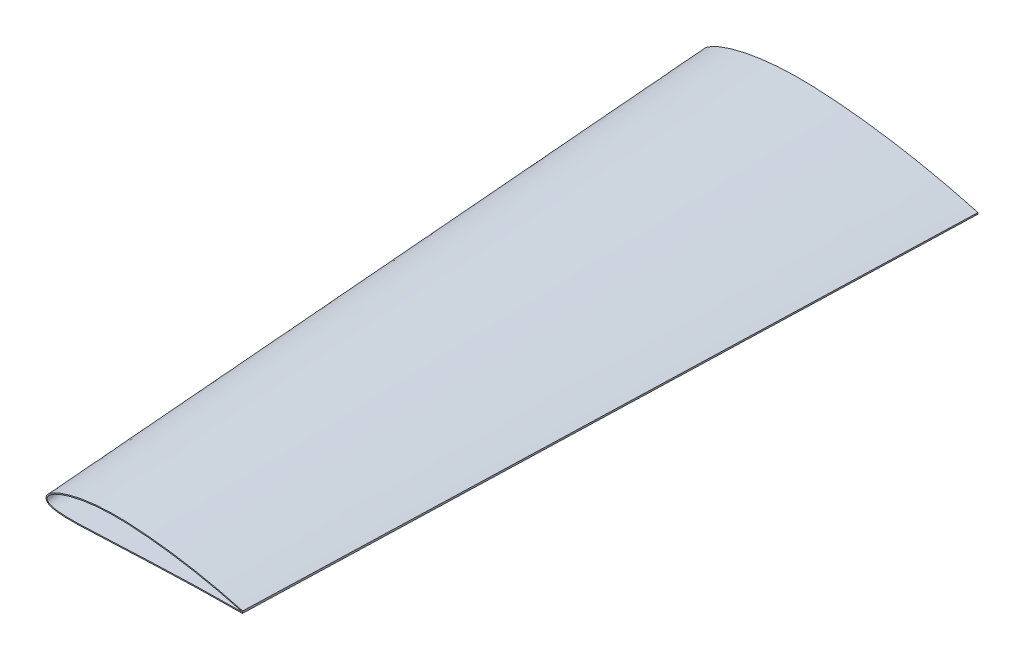
ISO-10303-21;
HEADER;
FILE_DESCRIPTION(('STEP AP214'),'2;1');
FILE_NAME('part.step','',(''),(''),'','','');
FILE_SCHEMA(('AUTOMOTIVE_DESIGN { 1 0 10303 214 1 1 1 1 }'));
ENDSEC;
DATA;
#1=APPLICATION_CONTEXT('core data for automotive mechanical design processes');
#2=APPLICATION_PROTOCOL_DEFINITION('international standard','automotive_design',2000,#1);
#3=PRODUCT_CONTEXT('',#1,'mechanical');
#4=PRODUCT('Part','Part','',(#3));
#5=PRODUCT_RELATED_PRODUCT_CATEGORY('part','',(#4));
#6=PRODUCT_DEFINITION_FORMATION('','',#4);
#7=PRODUCT_DEFINITION_CONTEXT('part definition',#1,'design');
#8=PRODUCT_DEFINITION('design','',#6,#7);
#9=PRODUCT_DEFINITION_SHAPE('','',#8);
#10=(LENGTH_UNIT() NAMED_UNIT(*) SI_UNIT(.MILLI.,.METRE.));
#11=(NAMED_UNIT(*) PLANE_ANGLE_UNIT() SI_UNIT($,.RADIAN.));
#12=(NAMED_UNIT(*) SI_UNIT($,.STERADIAN.) SOLID_ANGLE_UNIT());
#13=UNCERTAINTY_MEASURE_WITH_UNIT(LENGTH_MEASURE(1.E-05),#10,'distance_accuracy_value','');
#14=(GEOMETRIC_REPRESENTATION_CONTEXT(3) GLOBAL_UNCERTAINTY_ASSIGNED_CONTEXT((#13)) GLOBAL_UNIT_ASSIGNED_CONTEXT((#10,
#11,#12)) REPRESENTATION_CONTEXT('',''));
#15=CARTESIAN_POINT('',(0.,0.,0.));
#16=DIRECTION('',(0.,0.,1.));
#17=DIRECTION('',(1.,0.,0.));
#18=AXIS2_PLACEMENT_3D('',#15,#16,#17);
#19=CARTESIAN_POINT('',(515.542466757651,1.37291715323749,0.));
#20=CARTESIAN_POINT('',(473.761354348708,1.91504334392476,1333.5));
#21=CARTESIAN_POINT('',(504.948186056162,4.31562778068404,0.));
#22=CARTESIAN_POINT('',(466.241241660713,4.00387151815679,1333.5));
#23=CARTESIAN_POINT('',(483.688630885925,9.95175823918553,0.));
#24=CARTESIAN_POINT('',(451.160493971408,8.03690502890336,1333.5));
#25=CARTESIAN_POINT('',(440.91840439398,20.2408017386491,0.));
#26=CARTESIAN_POINT('',(420.805599887962,15.3578375738474,1333.5));
#27=CARTESIAN_POINT('',(397.820792051191,29.0759377638442,0.));
#28=CARTESIAN_POINT('',(390.221957363054,21.65962794748,1333.5));
#29=CARTESIAN_POINT('',(354.460600672312,36.4782376927597,0.));
#30=CARTESIAN_POINT('',(359.448862171338,26.9396472162238,1333.5));
#31=CARTESIAN_POINT('',(321.821436127745,41.287280697128,0.));
#32=CARTESIAN_POINT('',(336.282822397605,30.3682918829064,1333.5));
#33=CARTESIAN_POINT('',(289.075414397088,45.3159399144746,0.));
#34=CARTESIAN_POINT('',(313.039072197383,33.2450825322831,1333.5));
#35=CARTESIAN_POINT('',(256.234249309476,48.5142512287238,0.));
#36=CARTESIAN_POINT('',(289.723976775768,35.5318134186845,1333.5));
#37=CARTESIAN_POINT('',(223.317458576892,50.787173233681,0.));
#38=CARTESIAN_POINT('',(266.354818287414,37.1599691175304,1333.5));
#39=CARTESIAN_POINT('',(190.328241158101,52.0921492363557,0.));
#40=CARTESIAN_POINT('',(242.91690860674,38.106258583374,1333.5));
#41=CARTESIAN_POINT('',(162.799790856734,51.7149612737425,0.));
#42=CARTESIAN_POINT('',(223.339605024856,37.8569374336063,1333.5));
#43=CARTESIAN_POINT('',(140.815010685056,50.4814113602434,0.));
#44=CARTESIAN_POINT('',(207.702823599273,36.9927518576321,1333.5));
#45=CARTESIAN_POINT('',(124.359909385153,49.0521108646724,0.));
#46=CARTESIAN_POINT('',(195.99602938729,35.9854835703815,1333.5));
#47=CARTESIAN_POINT('',(107.957329171461,47.0863508807158,0.));
#48=CARTESIAN_POINT('',(184.323035776176,34.59573007404,1333.5));
#49=CARTESIAN_POINT('',(91.631280061329,44.5372092186544,0.));
#50=CARTESIAN_POINT('',(172.700036204777,32.7897404844962,1333.5));
#51=CARTESIAN_POINT('',(75.4136360051635,41.3429509123251,0.));
#52=CARTESIAN_POINT('',(161.148094659947,30.5229468259909,1333.5));
#53=CARTESIAN_POINT('',(62.025702194082,38.0735505204426,0.));
#54=CARTESIAN_POINT('',(151.604465980378,28.1992444571214,1333.5));
#55=CARTESIAN_POINT('',(51.4266197848401,35.0260164169072,0.));
#56=CARTESIAN_POINT('',(144.041887446398,26.0301562795153,1333.5));
#57=CARTESIAN_POINT('',(43.5465568697689,32.4984583099507,0.));
#58=CARTESIAN_POINT('',(138.41449545024,24.2291788913945,1333.5));
#59=CARTESIAN_POINT('',(35.7541118725182,29.6956733272348,0.));
#60=CARTESIAN_POINT('',(132.843221370915,22.2293587302536,1333.5));
#61=CARTESIAN_POINT('',(28.0755124200348,26.5705691180233,0.));
#62=CARTESIAN_POINT('',(127.343608813039,19.9952999808497,1333.5));
#63=CARTESIAN_POINT('',(20.555874406315,23.0470024261619,0.));
#64=CARTESIAN_POINT('',(121.942599672116,17.4689180578259,1333.5));
#65=CARTESIAN_POINT('',(14.4837569810482,19.6800078711009,0.));
#66=CARTESIAN_POINT('',(117.559968245804,15.04337614627,1333.5));
#67=CARTESIAN_POINT('',(9.83082821996991,16.6046362541371,0.));
#68=CARTESIAN_POINT('',(114.174757892656,12.8096231690394,1333.5));
#69=CARTESIAN_POINT('',(6.4884133940203,14.0525883692153,0.));
#70=CARTESIAN_POINT('',(111.721318113505,10.9395579815021,1333.5));
#71=CARTESIAN_POINT('',(3.37411745860041,11.1653229429713,0.));
#72=CARTESIAN_POINT('',(109.404447868835,8.79585196070452,1333.5));
#73=CARTESIAN_POINT('',(1.10893170730452,8.36681188823188,0.));
#74=CARTESIAN_POINT('',(107.664063642287,6.65710221065554,1333.5));
#75=CARTESIAN_POINT('',(-0.301805281426847,5.74949525675526,0.));
#76=CARTESIAN_POINT('',(106.551977804266,4.5904851843582,1333.5));
#77=CARTESIAN_POINT('',(-1.01759194588757,3.60243572224438,0.));
#78=CARTESIAN_POINT('',(105.953611387231,2.81739605685466,1333.5));
#79=CARTESIAN_POINT('',(-1.2495522623254,1.27648595976914,0.));
#80=CARTESIAN_POINT('',(105.759156489465,0.850568134802958,1333.5));
#81=CARTESIAN_POINT('',(-0.871053522600669,-1.0536259455248,0.));
#82=CARTESIAN_POINT('',(106.089924423004,-1.15154539440468,1333.5));
#83=CARTESIAN_POINT('',(0.0925312647460494,-3.18620229908168,0.));
#84=CARTESIAN_POINT('',(106.914986624156,-2.95461732726503,1333.5));
#85=CARTESIAN_POINT('',(1.96587574601528,-5.5997712947529,0.));
#86=CARTESIAN_POINT('',(108.477470245047,-4.94678785829278,1333.5));
#87=CARTESIAN_POINT('',(4.91676019063022,-7.81472721090731,0.));
#88=CARTESIAN_POINT('',(110.800424548259,-6.66376143743772,1333.5));
#89=CARTESIAN_POINT('',(8.76335605849131,-9.68666142986385,0.));
#90=CARTESIAN_POINT('',(113.698800911527,-8.06494132796826,1333.5));
#91=CARTESIAN_POINT('',(12.7457170988457,-11.0838560935036,0.));
#92=CARTESIAN_POINT('',(116.635824452286,-9.08879735743914,1333.5));
#93=CARTESIAN_POINT('',(16.7924123227071,-12.1621059985243,0.));
#94=CARTESIAN_POINT('',(119.584839473497,-9.87029719797451,1333.5));
#95=CARTESIAN_POINT('',(22.2359674012003,-13.2958830810498,0.));
#96=CARTESIAN_POINT('',(123.524096136929,-10.6860636031594,1333.5));
#97=CARTESIAN_POINT('',(29.0875943161226,-14.2923489224896,0.));
#98=CARTESIAN_POINT('',(128.447397124961,-11.3972340966206,1333.5));
#99=CARTESIAN_POINT('',(37.3368750688352,-15.0677746567505,0.));
#100=CARTESIAN_POINT('',(134.349639581766,-11.947718634808,1333.5));
#101=CARTESIAN_POINT('',(45.5951521604237,-15.5505139378374,0.));
#102=CARTESIAN_POINT('',(140.242283827755,-12.2886242625503,1333.5));
#103=CARTESIAN_POINT('',(53.8553570900479,-15.8209667772946,0.));
#104=CARTESIAN_POINT('',(146.127060513623,-12.4782668123123,1333.5));
#105=CARTESIAN_POINT('',(62.1137750735132,-15.9283521329175,0.));
#106=CARTESIAN_POINT('',(152.003712865923,-12.552064863902,1333.5));
#107=CARTESIAN_POINT('',(73.1205588589155,-15.9055453611833,0.));
#108=CARTESIAN_POINT('',(159.829522788246,-12.5328344567209,1333.5));
#109=CARTESIAN_POINT('',(86.8699195436529,-15.6312499740422,0.));
#110=CARTESIAN_POINT('',(169.596582504585,-12.3348738263077,1333.5));
#111=CARTESIAN_POINT('',(103.354857804001,-15.0577240266216,0.));
#112=CARTESIAN_POINT('',(181.297956986089,-11.9250394308122,1333.5));
#113=CARTESIAN_POINT('',(119.82883830323,-14.3351980837164,0.));
#114=CARTESIAN_POINT('',(192.985214326049,-11.4106375817264,1333.5));
#115=CARTESIAN_POINT('',(136.295462455293,-13.5306329693252,0.));
#116=CARTESIAN_POINT('',(204.662814159789,-10.8390693642151,1333.5));
#117=CARTESIAN_POINT('',(158.245357802019,-12.4217886668498,0.));
#118=CARTESIAN_POINT('',(220.224309063749,-10.0527014635403,1333.5));
#119=CARTESIAN_POINT('',(185.677219006089,-11.0451104976105,0.));
#120=CARTESIAN_POINT('',(239.663674820272,-9.07928745888814,1333.5));
#121=CARTESIAN_POINT('',(218.611438330042,-9.79297803817341,0.));
#122=CARTESIAN_POINT('',(263.00207611691,-8.19568423864289,1333.5));
#123=CARTESIAN_POINT('',(251.555145610756,-8.43171617870903,0.));
#124=CARTESIAN_POINT('',(286.363804333461,-7.22745079121833,1333.5));
#125=CARTESIAN_POINT('',(284.490185789946,-7.05887027421826,0.));
#126=CARTESIAN_POINT('',(309.70924451459,-6.25554907479826,1333.5));
#127=CARTESIAN_POINT('',(328.406681851027,-5.3338827127236,0.));
#128=CARTESIAN_POINT('',(340.837133227643,-5.03573266395796,1333.5));
#129=CARTESIAN_POINT('',(383.311814556076,-3.53289934021423,0.));
#130=CARTESIAN_POINT('',(379.748805846812,-3.76689211807182,1333.5));
#131=CARTESIAN_POINT('',(449.217902368611,-2.16377935447564,0.));
#132=CARTESIAN_POINT('',(426.454575487254,-2.80665513508761,1333.5));
#133=CARTESIAN_POINT('',(493.166185563474,-1.76961340399107,0.));
#134=CARTESIAN_POINT('',(457.604517174587,-2.5374479327564,1333.5));
#135=CARTESIAN_POINT('',(515.140000287505,-1.63716151339865,0.));
#136=CARTESIAN_POINT('',(473.17857996649,-2.44353039794196,1333.5));
#137=B_SPLINE_SURFACE_WITH_KNOTS('',3,1,((#19,#20),(#21,#22),(#23,#24),(#25,#26),(#27,#28),(#29,
#30),(#31,#32),(#33,#34),(#35,#36),(#37,#38),(#39,#40),(#41,#42),(#43,#44),(#45,#46),(#47,#48),
(#49,#50),(#51,#52),(#53,#54),(#55,#56),(#57,#58),(#59,#60),(#61,#62),(#63,#64),(#65,#66),(#67,
#68),(#69,#70),(#71,#72),(#73,#74),(#75,#76),(#77,#78),(#79,#80),(#81,#82),(#83,#84),(#85,#86),
(#87,#88),(#89,#90),(#91,#92),(#93,#94),(#95,#96),(#97,#98),(#99,#100),(#101,#102),(#103,#104),
(#105,#106),(#107,#108),(#109,#110),(#111,#112),(#113,#114),(#115,#116),(#117,#118),(#119,#120),
(#121,#122),(#123,#124),(#125,#126),(#127,#128),(#129,#130),(#131,#132),(#133,#134),(#135,
#136)),.UNSPECIFIED.,.F.,.F.,.F.,(4,1,1,1,1,1,1,1,1,1,1,1,1,1,1,1,1,1,1,1,1,1,1,1,1,1,1,1,1,1,1,
1,1,1,1,1,1,1,1,1,1,1,1,1,1,1,1,1,1,1,1,1,1,1,1,1,4),(2,2),(0.,0.03125,0.0625,0.125,0.15625,
0.1875,0.21875,0.25,0.28125,0.3125,0.34375,0.359375,0.375,0.390625,0.40625,0.421875,0.4375,
0.4453125,0.453125,0.4609375,0.46875,0.4765625,0.484375,0.48828125,0.4921875,0.49609375,0.5,
0.501953125,0.50390625,0.505859375,0.5078125,0.509765625,0.51171875,0.515625,0.51953125,
0.5234375,0.52734375,0.53125,0.5390625,0.546875,0.5546875,0.5625,0.5703125,0.578125,0.59375,
0.609375,0.625,0.640625,0.65625,0.6875,0.71875,0.75,0.78125,0.8125,0.875,0.9375,1.),(0.,1.),.UNSPECIFIED.);
#138=CARTESIAN_POINT('',(515.542466757651,1.37291715323749,0.));
#139=CARTESIAN_POINT('',(504.948186056162,4.31562778068404,0.));
#140=CARTESIAN_POINT('',(483.688630885925,9.95175823918553,0.));
#141=CARTESIAN_POINT('',(440.91840439398,20.2408017386491,0.));
#142=CARTESIAN_POINT('',(397.820792051191,29.0759377638442,0.));
#143=CARTESIAN_POINT('',(354.460600672312,36.4782376927597,0.));
#144=CARTESIAN_POINT('',(321.821436127745,41.287280697128,0.));
#145=CARTESIAN_POINT('',(289.075414397088,45.3159399144746,0.));
#146=CARTESIAN_POINT('',(256.234249309476,48.5142512287238,0.));
#147=CARTESIAN_POINT('',(223.317458576892,50.787173233681,0.));
#148=CARTESIAN_POINT('',(190.328241158101,52.0921492363557,0.));
#149=CARTESIAN_POINT('',(162.799790856734,51.7149612737425,0.));
#150=CARTESIAN_POINT('',(140.815010685056,50.4814113602434,0.));
#151=CARTESIAN_POINT('',(124.359909385153,49.0521108646724,0.));
#152=CARTESIAN_POINT('',(107.957329171461,47.0863508807158,0.));
#153=CARTESIAN_POINT('',(91.631280061329,44.5372092186544,0.));
#154=CARTESIAN_POINT('',(75.4136360051635,41.3429509123251,0.));
#155=CARTESIAN_POINT('',(62.025702194082,38.0735505204426,0.));
#156=CARTESIAN_POINT('',(51.4266197848401,35.0260164169072,0.));
#157=CARTESIAN_POINT('',(43.5465568697689,32.4984583099507,0.));
#158=CARTESIAN_POINT('',(35.7541118725182,29.6956733272348,0.));
#159=CARTESIAN_POINT('',(28.0755124200348,26.5705691180233,0.));
#160=CARTESIAN_POINT('',(20.555874406315,23.0470024261619,0.));
#161=CARTESIAN_POINT('',(14.4837569810482,19.6800078711009,0.));
#162=CARTESIAN_POINT('',(9.83082821996991,16.6046362541371,0.));
#163=CARTESIAN_POINT('',(6.4884133940203,14.0525883692153,0.));
#164=CARTESIAN_POINT('',(3.37411745860041,11.1653229429713,0.));
#165=CARTESIAN_POINT('',(1.10893170730452,8.36681188823188,0.));
#166=CARTESIAN_POINT('',(-0.301805281426847,5.74949525675526,0.));
#167=CARTESIAN_POINT('',(-1.01759194588757,3.60243572224438,0.));
#168=CARTESIAN_POINT('',(-1.2495522623254,1.27648595976914,0.));
#169=CARTESIAN_POINT('',(-0.871053522600669,-1.0536259455248,0.));
#170=CARTESIAN_POINT('',(0.0925312647460494,-3.18620229908168,0.));
#171=CARTESIAN_POINT('',(1.96587574601528,-5.5997712947529,0.));
#172=CARTESIAN_POINT('',(4.91676019063022,-7.81472721090731,0.));
#173=CARTESIAN_POINT('',(8.76335605849131,-9.68666142986385,0.));
#174=CARTESIAN_POINT('',(12.7457170988457,-11.0838560935036,0.));
#175=CARTESIAN_POINT('',(16.7924123227071,-12.1621059985243,0.));
#176=CARTESIAN_POINT('',(22.2359674012003,-13.2958830810498,0.));
#177=CARTESIAN_POINT('',(29.0875943161226,-14.2923489224896,0.));
#178=CARTESIAN_POINT('',(37.3368750688352,-15.0677746567505,0.));
#179=CARTESIAN_POINT('',(45.5951521604237,-15.5505139378374,0.));
#180=CARTESIAN_POINT('',(53.8553570900479,-15.8209667772946,0.));
#181=CARTESIAN_POINT('',(62.1137750735132,-15.9283521329175,0.));
#182=CARTESIAN_POINT('',(73.1205588589155,-15.9055453611833,0.));
#183=CARTESIAN_POINT('',(86.8699195436529,-15.6312499740422,0.));
#184=CARTESIAN_POINT('',(103.354857804001,-15.0577240266216,0.));
#185=CARTESIAN_POINT('',(119.82883830323,-14.3351980837164,0.));
#186=CARTESIAN_POINT('',(136.295462455293,-13.5306329693252,0.));
#187=CARTESIAN_POINT('',(158.245357802019,-12.4217886668498,0.));
#188=CARTESIAN_POINT('',(185.677219006089,-11.0451104976105,0.));
#189=CARTESIAN_POINT('',(218.611438330042,-9.79297803817341,0.));
#190=CARTESIAN_POINT('',(251.555145610756,-8.43171617870903,0.));
#191=CARTESIAN_POINT('',(284.490185789946,-7.05887027421826,0.));
#192=CARTESIAN_POINT('',(328.406681851027,-5.3338827127236,0.));
#193=CARTESIAN_POINT('',(383.311814556076,-3.53289934021423,0.));
#194=CARTESIAN_POINT('',(449.217902368611,-2.16377935447564,0.));
#195=CARTESIAN_POINT('',(493.166185563474,-1.76961340399107,0.));
#196=CARTESIAN_POINT('',(515.140000287505,-1.63716151339865,0.));
#197=B_SPLINE_CURVE_WITH_KNOTS('',3,(#138,#139,#140,#141,#142,#143,#144,#145,#146,#147,#148,
#149,#150,#151,#152,#153,#154,#155,#156,#157,#158,#159,#160,#161,#162,#163,#164,#165,#166,#167,
#168,#169,#170,#171,#172,#173,#174,#175,#176,#177,#178,#179,#180,#181,#182,#183,#184,#185,#186,
#187,#188,#189,#190,#191,#192,#193,#194,#195,#196),.UNSPECIFIED.,.F.,.F.,(4,1,1,1,1,1,1,1,1,1,1,
1,1,1,1,1,1,1,1,1,1,1,1,1,1,1,1,1,1,1,1,1,1,1,1,1,1,1,1,1,1,1,1,1,1,1,1,1,1,1,1,1,1,1,1,1,4),
(0.,0.03125,0.0625,0.125,0.15625,0.1875,0.21875,0.25,0.28125,0.3125,0.34375,0.359375,0.375,
0.390625,0.40625,0.421875,0.4375,0.4453125,0.453125,0.4609375,0.46875,0.4765625,0.484375,
0.48828125,0.4921875,0.49609375,0.5,0.501953125,0.50390625,0.505859375,0.5078125,0.509765625,
0.51171875,0.515625,0.51953125,0.5234375,0.52734375,0.53125,0.5390625,0.546875,0.5546875,0.5625,
0.5703125,0.578125,0.59375,0.609375,0.625,0.640625,0.65625,0.6875,0.71875,0.75,0.78125,0.8125,
0.875,0.9375,1.),.UNSPECIFIED.);
#198=CARTESIAN_POINT('',(515.542466757651,1.37291715323749,0.));
#199=VERTEX_POINT('',#198);
#200=CARTESIAN_POINT('',(515.140000287505,-1.63716151339865,0.));
#201=VERTEX_POINT('',#200);
#202=EDGE_CURVE('E12',#199,#201,#197,.T.);
#203=DIRECTION('',(-0.0314515585962615,-0.000604401805953986,0.999505094614491));
#204=VECTOR('',#203,1.);
#205=CARTESIAN_POINT('',(494.159290126997,-2.0403459556703,666.75));
#206=LINE('',#205,#204);
#207=CARTESIAN_POINT('',(473.17857996649,-2.44353039794196,1333.5));
#208=VERTEX_POINT('',#207);
#209=EDGE_CURVE('E108',#201,#208,#206,.T.);
#210=CARTESIAN_POINT('',(473.761354348708,1.91504334392476,1333.5));
#211=CARTESIAN_POINT('',(466.241241660713,4.00387151815679,1333.5));
#212=CARTESIAN_POINT('',(451.160493971408,8.03690502890336,1333.5));
#213=CARTESIAN_POINT('',(420.805599887962,15.3578375738474,1333.5));
#214=CARTESIAN_POINT('',(390.221957363054,21.65962794748,1333.5));
#215=CARTESIAN_POINT('',(359.448862171338,26.9396472162238,1333.5));
#216=CARTESIAN_POINT('',(336.282822397605,30.3682918829064,1333.5));
#217=CARTESIAN_POINT('',(313.039072197383,33.2450825322831,1333.5));
#218=CARTESIAN_POINT('',(289.723976775768,35.5318134186845,1333.5));
#219=CARTESIAN_POINT('',(266.354818287414,37.1599691175304,1333.5));
#220=CARTESIAN_POINT('',(242.91690860674,38.106258583374,1333.5));
#221=CARTESIAN_POINT('',(223.339605024856,37.8569374336063,1333.5));
#222=CARTESIAN_POINT('',(207.702823599273,36.9927518576321,1333.5));
#223=CARTESIAN_POINT('',(195.99602938729,35.9854835703815,1333.5));
#224=CARTESIAN_POINT('',(184.323035776176,34.59573007404,1333.5));
#225=CARTESIAN_POINT('',(172.700036204777,32.7897404844962,1333.5));
#226=CARTESIAN_POINT('',(161.148094659947,30.5229468259909,1333.5));
#227=CARTESIAN_POINT('',(151.604465980378,28.1992444571214,1333.5));
#228=CARTESIAN_POINT('',(144.041887446398,26.0301562795153,1333.5));
#229=CARTESIAN_POINT('',(138.41449545024,24.2291788913945,1333.5));
#230=CARTESIAN_POINT('',(132.843221370915,22.2293587302536,1333.5));
#231=CARTESIAN_POINT('',(127.343608813039,19.9952999808497,1333.5));
#232=CARTESIAN_POINT('',(121.942599672116,17.4689180578259,1333.5));
#233=CARTESIAN_POINT('',(117.559968245804,15.04337614627,1333.5));
#234=CARTESIAN_POINT('',(114.174757892656,12.8096231690394,1333.5));
#235=CARTESIAN_POINT('',(111.721318113505,10.9395579815021,1333.5));
#236=CARTESIAN_POINT('',(109.404447868835,8.79585196070452,1333.5));
#237=CARTESIAN_POINT('',(107.664063642287,6.65710221065554,1333.5));
#238=CARTESIAN_POINT('',(106.551977804266,4.5904851843582,1333.5));
#239=CARTESIAN_POINT('',(105.953611387231,2.81739605685466,1333.5));
#240=CARTESIAN_POINT('',(105.759156489465,0.850568134802958,1333.5));
#241=CARTESIAN_POINT('',(106.089924423004,-1.15154539440468,1333.5));
#242=CARTESIAN_POINT('',(106.914986624156,-2.95461732726503,1333.5));
#243=CARTESIAN_POINT('',(108.477470245047,-4.94678785829278,1333.5));
#244=CARTESIAN_POINT('',(110.800424548259,-6.66376143743772,1333.5));
#245=CARTESIAN_POINT('',(113.698800911527,-8.06494132796826,1333.5));
#246=CARTESIAN_POINT('',(116.635824452286,-9.08879735743914,1333.5));
#247=CARTESIAN_POINT('',(119.584839473497,-9.87029719797451,1333.5));
#248=CARTESIAN_POINT('',(123.524096136929,-10.6860636031594,1333.5));
#249=CARTESIAN_POINT('',(128.447397124961,-11.3972340966206,1333.5));
#250=CARTESIAN_POINT('',(134.349639581766,-11.947718634808,1333.5));
#251=CARTESIAN_POINT('',(140.242283827755,-12.2886242625503,1333.5));
#252=CARTESIAN_POINT('',(146.127060513623,-12.4782668123123,1333.5));
#253=CARTESIAN_POINT('',(152.003712865923,-12.552064863902,1333.5));
#254=CARTESIAN_POINT('',(159.829522788246,-12.5328344567209,1333.5));
#255=CARTESIAN_POINT('',(169.596582504585,-12.3348738263077,1333.5));
#256=CARTESIAN_POINT('',(181.297956986089,-11.9250394308122,1333.5));
#257=CARTESIAN_POINT('',(192.985214326049,-11.4106375817264,1333.5));
#258=CARTESIAN_POINT('',(204.662814159789,-10.8390693642151,1333.5));
#259=CARTESIAN_POINT('',(220.224309063749,-10.0527014635403,1333.5));
#260=CARTESIAN_POINT('',(239.663674820272,-9.07928745888814,1333.5));
#261=CARTESIAN_POINT('',(263.00207611691,-8.19568423864289,1333.5));
#262=CARTESIAN_POINT('',(286.363804333461,-7.22745079121833,1333.5));
#263=CARTESIAN_POINT('',(309.70924451459,-6.25554907479826,1333.5));
#264=CARTESIAN_POINT('',(340.837133227643,-5.03573266395796,1333.5));
#265=CARTESIAN_POINT('',(379.748805846812,-3.76689211807182,1333.5));
#266=CARTESIAN_POINT('',(426.454575487254,-2.80665513508761,1333.5));
#267=CARTESIAN_POINT('',(457.604517174587,-2.5374479327564,1333.5));
#268=CARTESIAN_POINT('',(473.17857996649,-2.44353039794196,1333.5));
#269=B_SPLINE_CURVE_WITH_KNOTS('',3,(#210,#211,#212,#213,#214,#215,#216,#217,#218,#219,#220,
#221,#222,#223,#224,#225,#226,#227,#228,#229,#230,#231,#232,#233,#234,#235,#236,#237,#238,#239,
#240,#241,#242,#243,#244,#245,#246,#247,#248,#249,#250,#251,#252,#253,#254,#255,#256,#257,#258,
#259,#260,#261,#262,#263,#264,#265,#266,#267,#268),.UNSPECIFIED.,.F.,.F.,(4,1,1,1,1,1,1,1,1,1,1,
1,1,1,1,1,1,1,1,1,1,1,1,1,1,1,1,1,1,1,1,1,1,1,1,1,1,1,1,1,1,1,1,1,1,1,1,1,1,1,1,1,1,1,1,1,4),
(0.,0.03125,0.0625,0.125,0.15625,0.1875,0.21875,0.25,0.28125,0.3125,0.34375,0.359375,0.375,
0.390625,0.40625,0.421875,0.4375,0.4453125,0.453125,0.4609375,0.46875,0.4765625,0.484375,
0.48828125,0.4921875,0.49609375,0.5,0.501953125,0.50390625,0.505859375,0.5078125,0.509765625,
0.51171875,0.515625,0.51953125,0.5234375,0.52734375,0.53125,0.5390625,0.546875,0.5546875,0.5625,
0.5703125,0.578125,0.59375,0.609375,0.625,0.640625,0.65625,0.6875,0.71875,0.75,0.78125,0.8125,
0.875,0.9375,1.),.UNSPECIFIED.);
#270=CARTESIAN_POINT('',(473.761354348708,1.91504334392476,1333.5));
#271=VERTEX_POINT('',#270);
#272=EDGE_CURVE('E154',#271,#208,#269,.T.);
#273=DIRECTION('',(-0.0313165474447222,0.000406344388476608,0.999509434042711));
#274=VECTOR('',#273,1.);
#275=CARTESIAN_POINT('',(494.651910553179,1.64398024858112,666.75));
#276=LINE('',#275,#274);
#277=EDGE_CURVE('E171',#199,#271,#276,.T.);
#278=ORIENTED_EDGE('',*,*,#202,.T.);
#279=ORIENTED_EDGE('',*,*,#209,.T.);
#280=ORIENTED_EDGE('',*,*,#272,.F.);
#281=ORIENTED_EDGE('',*,*,#277,.F.);
#282=EDGE_LOOP('',(#278,#279,#280,#281));
#283=FACE_BOUND('',#282,.T.);
#284=ADVANCED_FACE('F99',(#283),#137,.T.);
#285=CARTESIAN_POINT('',(515.140000287505,-1.63716151339865,0.));
#286=DIRECTION('',(0.99070012302079,-0.132462844212288,0.0310943909697982));
#287=DIRECTION('',(0.13252692727453,0.991179405328405,0.));
#288=AXIS2_PLACEMENT_3D('',#285,#286,#287);
#289=PLANE('',#288);
#290=DIRECTION('',(0.13252692727453,0.991179405328405,0.));
#291=VECTOR('',#290,1.);
#292=CARTESIAN_POINT('',(515.341233522578,-0.132122180080578,0.));
#293=LINE('',#292,#291);
#294=EDGE_CURVE('E177',#201,#199,#293,.T.);
#295=ORIENTED_EDGE('',*,*,#294,.T.);
#296=ORIENTED_EDGE('',*,*,#277,.T.);
#297=DIRECTION('',(0.13252818509165,0.991179237149524,0.));
#298=VECTOR('',#297,1.);
#299=CARTESIAN_POINT('',(473.469967157599,-0.264243527008601,1333.5));
#300=LINE('',#299,#298);
#301=EDGE_CURVE('E103',#208,#271,#300,.T.);
#302=ORIENTED_EDGE('',*,*,#301,.F.);
#303=ORIENTED_EDGE('',*,*,#209,.F.);
#304=EDGE_LOOP('',(#295,#296,#302,#303));
#305=FACE_BOUND('',#304,.T.);
#306=ADVANCED_FACE('F101',(#305),#289,.T.);
#307=CARTESIAN_POINT('',(0.789698427813787,7.6809404147223,0.));
#308=DIRECTION('',(0.,0.,-1.));
#309=DIRECTION('',(-1.,0.,0.));
#310=AXIS2_PLACEMENT_3D('',#307,#308,#309);
#311=PLANE('',#310);
#312=DIRECTION('',(0.132526927273884,0.991179405328492,0.));
#313=VECTOR('',#312,1.);
#314=CARTESIAN_POINT('',(514.35,0.,0.));
#315=LINE('',#314,#313);
#316=CARTESIAN_POINT('',(514.264104,-0.642423,0.));
#317=VERTEX_POINT('',#316);
#318=CARTESIAN_POINT('',(514.435896,0.642423,0.));
#319=VERTEX_POINT('',#318);
#320=EDGE_CURVE('E146',#317,#319,#315,.T.);
#321=ORIENTED_EDGE('',*,*,#320,.T.);
#322=CARTESIAN_POINT('',(514.435896,0.642423,0.));
#323=CARTESIAN_POINT('',(512.94541606473,1.05642478729432,0.));
#324=CARTESIAN_POINT('',(508.825527987807,2.19256313847687,0.));
#325=CARTESIAN_POINT('',(498.403665900981,5.01203318174744,0.));
#326=CARTESIAN_POINT('',(480.522495849854,9.65821949062991,0.));
#327=CARTESIAN_POINT('',(461.6976352898,14.2178535400194,0.));
#328=CARTESIAN_POINT('',(441.398480906032,18.8488091834658,0.));
#329=CARTESIAN_POINT('',(425.837811960539,22.2064809442018,0.));
#330=CARTESIAN_POINT('',(404.739444713579,26.4880124213888,0.));
#331=CARTESIAN_POINT('',(386.633295981129,29.9022035696143,0.));
#332=CARTESIAN_POINT('',(367.797715069162,33.1789779456841,0.));
#333=CARTESIAN_POINT('',(347.785757595347,36.4491216571071,0.));
#334=CARTESIAN_POINT('',(321.929657212203,40.2530036004365,0.));
#335=CARTESIAN_POINT('',(290.1575236074,44.1855594770424,0.));
#336=CARTESIAN_POINT('',(263.205160570892,46.8408013496332,0.));
#337=CARTESIAN_POINT('',(241.481594589181,48.5315437184497,0.));
#338=CARTESIAN_POINT('',(225.228952555751,49.5578635284934,0.));
#339=CARTESIAN_POINT('',(209.026056900066,50.3454166531266,0.));
#340=CARTESIAN_POINT('',(192.91849394169,50.8313771990957,0.));
#341=CARTESIAN_POINT('',(176.973461880223,50.8910826974378,0.));
#342=CARTESIAN_POINT('',(156.379693514986,50.443365915704,0.));
#343=CARTESIAN_POINT('',(131.753417716594,48.9407852546156,0.));
#344=CARTESIAN_POINT('',(108.05912810278,46.1590202990312,0.));
#345=CARTESIAN_POINT('',(90.3059853486501,43.2428512836833,0.));
#346=CARTESIAN_POINT('',(77.9859974202083,40.8195537307709,0.));
#347=CARTESIAN_POINT('',(66.4275233836712,38.1487409922866,0.));
#348=CARTESIAN_POINT('',(55.6793455107768,35.2676421154893,0.));
#349=CARTESIAN_POINT('',(45.7858241467059,32.2152976573816,0.));
#350=CARTESIAN_POINT('',(36.7859672757282,29.0315137261456,0.));
#351=CARTESIAN_POINT('',(28.7128278267648,25.7579258766505,0.));
#352=CARTESIAN_POINT('',(21.5951478101318,22.4321597042956,0.));
#353=CARTESIAN_POINT('',(15.4550025655565,19.0919579210996,0.));
#354=CARTESIAN_POINT('',(10.3087653268058,15.7705328063585,0.));
#355=CARTESIAN_POINT('',(6.16514914406117,12.4956664129553,0.));
#356=CARTESIAN_POINT('',(3.02641944483636,9.28349534240597,0.));
#357=CARTESIAN_POINT('',(0.892546496087793,6.13234383969225,0.));
#358=CARTESIAN_POINT('',(-0.207749289706149,3.01155653148428,0.));
#359=CARTESIAN_POINT('',(-0.180705806156611,-0.0362548467185213,0.));
#360=CARTESIAN_POINT('',(0.964936352383728,-2.85745424735354,0.));
#361=CARTESIAN_POINT('',(3.15942728449595,-5.31808870006715,0.));
#362=CARTESIAN_POINT('',(6.28988095208388,-7.43127852790095,0.));
#363=CARTESIAN_POINT('',(10.3346827005672,-9.249116332702,0.));
#364=CARTESIAN_POINT('',(15.2853400246204,-10.7963791421872,0.));
#365=CARTESIAN_POINT('',(21.128740187722,-12.0830529684782,0.));
#366=CARTESIAN_POINT('',(27.8434078851453,-13.1181164538871,0.));
#367=CARTESIAN_POINT('',(35.402386955595,-13.909930601921,0.));
#368=CARTESIAN_POINT('',(43.774859618114,-14.4685589897819,0.));
#369=CARTESIAN_POINT('',(52.9268307234789,-14.8088115512827,0.));
#370=CARTESIAN_POINT('',(62.8222991220521,-14.9425562599767,0.));
#371=CARTESIAN_POINT('',(73.4230791296659,-14.8903632448912,0.));
#372=CARTESIAN_POINT('',(84.6899003138328,-14.669251653047,0.));
#373=CARTESIAN_POINT('',(96.5819965888191,-14.3020165903753,0.));
#374=CARTESIAN_POINT('',(113.568649316398,-13.6339776986205,0.));
#375=CARTESIAN_POINT('',(136.038145587383,-12.55213020457,0.));
#376=CARTESIAN_POINT('',(159.255895604522,-11.3625421508041,0.));
#377=CARTESIAN_POINT('',(178.63980440041,-10.426403347717,0.));
#378=CARTESIAN_POINT('',(193.687789822616,-9.74571384869642,0.));
#379=CARTESIAN_POINT('',(209.076975035284,-9.14665953276347,0.));
#380=CARTESIAN_POINT('',(224.747841415959,-8.53645233231427,0.));
#381=CARTESIAN_POINT('',(251.268043050231,-7.44592583941877,0.));
#382=CARTESIAN_POINT('',(288.183310261078,-5.89213782868748,0.));
#383=CARTESIAN_POINT('',(324.855252418006,-4.48957076349408,0.));
#384=CARTESIAN_POINT('',(350.49312127892,-3.63029902647992,0.));
#385=CARTESIAN_POINT('',(378.655916259754,-2.75217689665205,0.));
#386=CARTESIAN_POINT('',(405.834971812742,-2.0685118801751,0.));
#387=CARTESIAN_POINT('',(435.510495417732,-1.50653575485183,0.));
#388=CARTESIAN_POINT('',(456.175948723462,-1.17512970443536,0.));
#389=CARTESIAN_POINT('',(475.257418188367,-0.951341238396082,0.));
#390=CARTESIAN_POINT('',(490.933297619623,-0.80445748931804,0.));
#391=CARTESIAN_POINT('',(500.158698947766,-0.732541232247515,0.));
#392=CARTESIAN_POINT('',(508.450560131903,-0.676259098232435,0.));
#393=CARTESIAN_POINT('',(512.718654990296,-0.651738526034978,0.));
#394=CARTESIAN_POINT('',(514.264104,-0.642423,0.));
#395=B_SPLINE_CURVE_WITH_KNOTS('',3,(#322,#323,#324,#325,#326,#327,#328,#329,#330,#331,#332,
#333,#334,#335,#336,#337,#338,#339,#340,#341,#342,#343,#344,#345,#346,#347,#348,#349,#350,#351,
#352,#353,#354,#355,#356,#357,#358,#359,#360,#361,#362,#363,#364,#365,#366,#367,#368,#369,#370,
#371,#372,#373,#374,#375,#376,#377,#378,#379,#380,#381,#382,#383,#384,#385,#386,#387,#388,#389,
#390,#391,#392,#393,#394),.UNSPECIFIED.,.F.,.F.,(4,1,1,1,1,1,1,1,1,1,1,1,1,1,1,1,1,1,1,1,1,1,1,
1,1,1,1,1,1,1,1,1,1,1,1,1,1,1,1,1,1,1,1,1,1,1,1,1,1,1,1,1,1,1,1,1,1,1,1,1,1,1,1,1,1,1,1,1,1,1,
4),(0.,0.00440644036857422,0.0121737299937428,0.0307541939074956,0.0570317960242728,
0.0673450879951363,0.0900623576232318,0.10237566463772,0.128668991756761,0.142544998543184,
0.15683462681616,0.18642899877217,0.216985200702991,0.248022540320765,0.263568549379391,
0.27905079415257,0.294409505596858,0.30977601328067,0.324950675699587,0.339824563938648,
0.368445781112026,0.395201613054168,0.407751474728481,0.419686063023906,0.43096195418779,
0.441537442035329,0.451376775359951,0.460447411472792,0.468722554437909,0.476182575407291,
0.482814921279424,0.488618662978692,0.493609654903146,0.497829924786717,0.501364693853581,
0.504371830566402,0.507112524612496,0.509853114307978,0.512854812617694,0.516367768618666,
0.52053959257564,0.525445047045249,0.531118392327961,0.537568297479124,0.544788289677284,
0.552761790220897,0.561466342861132,0.570873121381836,0.580950014659322,0.591662173849693,
0.602972463274888,0.614840808775719,0.640086430252391,0.667051539604885,0.681064303706584,
0.695366712683046,0.709960021857495,0.724934164323908,0.740039734181759,0.785567804764558,
0.830182037591703,0.844577388167962,0.858639375621105,0.910443941544171,0.922021682965094,
0.943186534459237,0.969317876146513,0.976379715358717,0.987841938817817,0.99559763857599,1.),.UNSPECIFIED.);
#396=EDGE_CURVE('E139',#319,#317,#395,.T.);
#397=ORIENTED_EDGE('',*,*,#396,.T.);
#398=EDGE_LOOP('',(#321,#397));
#399=FACE_BOUND('',#398,.T.);
#400=ORIENTED_EDGE('',*,*,#294,.F.);
#401=ORIENTED_EDGE('',*,*,#202,.F.);
#402=EDGE_LOOP('',(#400,#401));
#403=FACE_BOUND('',#402,.T.);
#404=ADVANCED_FACE('F151',(#399,#403),#311,.T.);
#405=CARTESIAN_POINT('',(107.40939397805,6.11081318522634,1333.5));
#406=DIRECTION('',(0.,0.,-1.));
#407=DIRECTION('',(-1.,0.,0.));
#408=AXIS2_PLACEMENT_3D('',#405,#406,#407);
#409=PLANE('',#408);
#410=CARTESIAN_POINT('',(471.548210999999,0.454057999987208,1333.5));
#411=CARTESIAN_POINT('',(470.494753754272,0.746672122477082,1333.5));
#412=CARTESIAN_POINT('',(467.582858646706,1.5496815807817,1333.5));
#413=CARTESIAN_POINT('',(460.216788574629,3.54245650519408,1333.5));
#414=CARTESIAN_POINT('',(447.578553463452,6.82633180706164,1333.5));
#415=CARTESIAN_POINT('',(434.273328814241,10.0490386732759,1333.5));
#416=CARTESIAN_POINT('',(419.926087189139,13.3221532297202,1333.5));
#417=CARTESIAN_POINT('',(408.927959425464,15.6953211175711,1333.5));
#418=CARTESIAN_POINT('',(394.015842123828,18.7214664036661,1333.5));
#419=CARTESIAN_POINT('',(381.218595098486,21.1345812654302,1333.5));
#420=CARTESIAN_POINT('',(367.905792856357,23.4505740973592,1333.5));
#421=CARTESIAN_POINT('',(353.761538310277,25.7618787300853,1333.5));
#422=CARTESIAN_POINT('',(335.486701716051,28.4504232108985,1333.5));
#423=CARTESIAN_POINT('',(313.030471822044,31.2299172839469,1333.5));
#424=CARTESIAN_POINT('',(293.980807719015,33.1066147362166,1333.5));
#425=CARTESIAN_POINT('',(278.626806044593,34.3016163153823,1333.5));
#426=CARTESIAN_POINT('',(267.139599487229,35.0270082162218,1333.5));
#427=CARTESIAN_POINT('',(255.68755287874,35.5836425109885,1333.5));
#428=CARTESIAN_POINT('',(244.302886345107,35.927115011996,1333.5));
#429=CARTESIAN_POINT('',(233.03309484109,35.9693136697484,1333.5));
#430=CARTESIAN_POINT('',(218.477622951542,35.6528728571563,1333.5));
#431=CARTESIAN_POINT('',(201.072014755019,34.5908623765454,1333.5));
#432=CARTESIAN_POINT('',(184.325124716788,32.6247399387227,1333.5));
#433=CARTESIAN_POINT('',(171.777378415618,30.5636207824256,1333.5));
#434=CARTESIAN_POINT('',(163.069732670962,28.8508575855725,1333.5));
#435=CARTESIAN_POINT('',(154.900317065627,26.9631539946023,1333.5));
#436=CARTESIAN_POINT('',(147.303611251825,24.9268214541628,1333.5));
#437=CARTESIAN_POINT('',(140.310968151963,22.769453635662,1333.5));
#438=CARTESIAN_POINT('',(133.949958304024,20.5191869488186,1333.5));
#439=CARTESIAN_POINT('',(128.243943222938,18.2054477590111,1333.5));
#440=CARTESIAN_POINT('',(123.213237815739,15.8548286689227,1333.5));
#441=CARTESIAN_POINT('',(118.873443260835,13.4940076202957,1333.5));
#442=CARTESIAN_POINT('',(115.236133633843,11.1464567811042,1333.5));
#443=CARTESIAN_POINT('',(112.307465918484,8.83181420624795,1333.5));
#444=CARTESIAN_POINT('',(110.08904347215,6.5614828531469,1333.5));
#445=CARTESIAN_POINT('',(108.580843334353,4.33427994666272,1333.5));
#446=CARTESIAN_POINT('',(107.80316531111,2.12853842165356,1333.5));
#447=CARTESIAN_POINT('',(107.822278679744,-0.0256246268723389,1333.5));
#448=CARTESIAN_POINT('',(108.632008069895,-2.01962024822909,1333.5));
#449=CARTESIAN_POINT('',(110.183051961843,-3.75877273588915,1333.5));
#450=CARTESIAN_POINT('',(112.395626013006,-5.25235382542728,1333.5));
#451=CARTESIAN_POINT('',(115.25445101078,-6.53718512599626,1333.5));
#452=CARTESIAN_POINT('',(118.753527326803,-7.63077372493691,1333.5));
#453=CARTESIAN_POINT('',(122.883584864182,-8.5401822189999,1333.5));
#454=CARTESIAN_POINT('',(127.629445640547,-9.27175628389868,1333.5));
#455=CARTESIAN_POINT('',(132.972057337769,-9.83140097628574,1333.5));
#456=CARTESIAN_POINT('',(138.889638054262,-10.2262353599569,1333.5));
#457=CARTESIAN_POINT('',(145.358160775775,-10.4667209136588,1333.5));
#458=CARTESIAN_POINT('',(152.352180294713,-10.5612512049219,1333.5));
#459=CARTESIAN_POINT('',(159.844707071525,-10.5243613303354,1333.5));
#460=CARTESIAN_POINT('',(167.807985065512,-10.3680815224385,1333.5));
#461=CARTESIAN_POINT('',(176.213201295296,-10.1085245112694,1333.5));
#462=CARTESIAN_POINT('',(188.219199631016,-9.63635992298278,1333.5));
#463=CARTESIAN_POINT('',(204.100417700833,-8.87171960345737,1333.5));
#464=CARTESIAN_POINT('',(220.510493957693,-8.03093220714318,1333.5));
#465=CARTESIAN_POINT('',(234.210849069535,-7.36927959083769,1333.5));
#466=CARTESIAN_POINT('',(244.846616793399,-6.88817544351863,1333.5));
#467=CARTESIAN_POINT('',(255.72354084923,-6.4647680381547,1333.5));
#468=CARTESIAN_POINT('',(266.799554765253,-6.03348112050647,1333.5));
#469=CARTESIAN_POINT('',(285.543771333332,-5.26270616042734,1333.5));
#470=CARTESIAN_POINT('',(311.635117149994,-4.16450503488361,1333.5));
#471=CARTESIAN_POINT('',(337.554484160904,-3.17318302443308,1333.5));
#472=CARTESIAN_POINT('',(355.67507629834,-2.56585970842198,1333.5));
#473=CARTESIAN_POINT('',(375.580262074813,-1.94521060265128,1333.5));
#474=CARTESIAN_POINT('',(394.790150732246,-1.4620028025464,1333.5));
#475=CARTESIAN_POINT('',(415.764516641898,-1.06480467367074,1333.5));
#476=CARTESIAN_POINT('',(430.370654857757,-0.830568995520572,1333.5));
#477=CARTESIAN_POINT('',(443.857249442588,-0.672400602459617,1333.5));
#478=CARTESIAN_POINT('',(454.936805434006,-0.568581926745332,1333.5));
#479=CARTESIAN_POINT('',(461.457228295663,-0.517751755927463,1333.5));
#480=CARTESIAN_POINT('',(467.317833669565,-0.477973145484204,1333.5));
#481=CARTESIAN_POINT('',(470.334484120158,-0.460645014779035,1333.5));
#482=CARTESIAN_POINT('',(471.426788999999,-0.454058000012805,1333.5));
#483=B_SPLINE_CURVE_WITH_KNOTS('',3,(#410,#411,#412,#413,#414,#415,#416,#417,#418,#419,#420,
#421,#422,#423,#424,#425,#426,#427,#428,#429,#430,#431,#432,#433,#434,#435,#436,#437,#438,#439,
#440,#441,#442,#443,#444,#445,#446,#447,#448,#449,#450,#451,#452,#453,#454,#455,#456,#457,#458,
#459,#460,#461,#462,#463,#464,#465,#466,#467,#468,#469,#470,#471,#472,#473,#474,#475,#476,#477,
#478,#479,#480,#481,#482),.UNSPECIFIED.,.F.,.F.,(4,1,1,1,1,1,1,1,1,1,1,1,1,1,1,1,1,1,1,1,1,1,1,
1,1,1,1,1,1,1,1,1,1,1,1,1,1,1,1,1,1,1,1,1,1,1,1,1,1,1,1,1,1,1,1,1,1,1,1,1,1,1,1,1,1,1,1,1,1,1,
4),(0.,0.00440644036857422,0.0121737299937428,0.0307541939074956,0.0570317960242728,
0.0673450879951363,0.0900623576232318,0.10237566463772,0.128668991756761,0.142544998543184,
0.15683462681616,0.18642899877217,0.216985200702991,0.248022540320765,0.263568549379391,
0.27905079415257,0.294409505596858,0.30977601328067,0.324950675699587,0.339824563938648,
0.368445781112026,0.395201613054168,0.407751474728481,0.419686063023906,0.43096195418779,
0.441537442035329,0.451376775359951,0.460447411472792,0.468722554437909,0.476182575407291,
0.482814921279424,0.488618662978692,0.493609654903146,0.497829924786717,0.501364693853581,
0.504371830566402,0.507112524612496,0.509853114307978,0.512854812617694,0.516367768618666,
0.52053959257564,0.525445047045249,0.531118392327961,0.537568297479124,0.544788289677284,
0.552761790220897,0.561466342861132,0.570873121381836,0.580950014659322,0.591662173849693,
0.602972463274888,0.614840808775719,0.640086430252391,0.667051539604885,0.681064303706584,
0.695366712683046,0.709960021857495,0.724934164323908,0.740039734181759,0.785567804764558,
0.830182037591703,0.844577388167962,0.858639375621105,0.910443941544171,0.922021682965094,
0.943186534459237,0.969317876146513,0.976379715358717,0.987841938817817,0.99559763857599,1.),.UNSPECIFIED.);
#484=CARTESIAN_POINT('',(471.548210999999,0.454057999987209,1333.5));
#485=VERTEX_POINT('',#484);
#486=CARTESIAN_POINT('',(471.426788999999,-0.454058000012805,1333.5));
#487=VERTEX_POINT('',#486);
#488=EDGE_CURVE('E156',#485,#487,#483,.T.);
#489=ORIENTED_EDGE('',*,*,#488,.F.);
#490=DIRECTION('',(0.132528185092149,0.991179237149458,0.));
#491=VECTOR('',#490,1.);
#492=CARTESIAN_POINT('',(471.487499999999,-1.27983561248879E-11,1333.5));
#493=LINE('',#492,#491);
#494=EDGE_CURVE('E148',#487,#485,#493,.T.);
#495=ORIENTED_EDGE('',*,*,#494,.F.);
#496=EDGE_LOOP('',(#489,#495));
#497=FACE_BOUND('',#496,.T.);
#498=ORIENTED_EDGE('',*,*,#272,.T.);
#499=ORIENTED_EDGE('',*,*,#301,.T.);
#500=EDGE_LOOP('',(#498,#499));
#501=FACE_BOUND('',#500,.T.);
#502=ADVANCED_FACE('F186',(#497,#501),#409,.F.);
#503=CARTESIAN_POINT('',(514.264104,-0.642423,0.));
#504=DIRECTION('',(0.990676755749762,-0.132459719860366,0.0318431818705373));
#505=DIRECTION('',(0.132526927273884,0.991179405328492,0.));
#506=AXIS2_PLACEMENT_3D('',#503,#504,#505);
#507=PLANE('',#506);
#508=ORIENTED_EDGE('',*,*,#320,.F.);
#509=DIRECTION('',(-0.0321074080934547,0.000141183263356079,0.999484414292092));
#510=VECTOR('',#509,1.);
#511=CARTESIAN_POINT('',(492.8454465,-0.548240500006403,666.75));
#512=LINE('',#511,#510);
#513=EDGE_CURVE('E116',#317,#487,#512,.T.);
#514=ORIENTED_EDGE('',*,*,#513,.T.);
#515=ORIENTED_EDGE('',*,*,#494,.T.);
#516=DIRECTION('',(-0.0321451224088134,-0.000141183092138155,0.999483202046266));
#517=VECTOR('',#516,1.);
#518=CARTESIAN_POINT('',(492.992053499999,0.548240499993604,666.75));
#519=LINE('',#518,#517);
#520=EDGE_CURVE('E121',#319,#485,#519,.T.);
#521=ORIENTED_EDGE('',*,*,#520,.F.);
#522=EDGE_LOOP('',(#508,#514,#515,#521));
#523=FACE_BOUND('',#522,.T.);
#524=ADVANCED_FACE('F145',(#523),#507,.F.);
#525=CARTESIAN_POINT('',(514.435896,0.642423,0.));
#526=CARTESIAN_POINT('',(471.548210999999,0.454057999987208,1333.5));
#527=CARTESIAN_POINT('',(512.94541606473,1.05642478729432,0.));
#528=CARTESIAN_POINT('',(470.494753754272,0.746672122477082,1333.5));
#529=CARTESIAN_POINT('',(508.825527987807,2.19256313847687,0.));
#530=CARTESIAN_POINT('',(467.582858646706,1.5496815807817,1333.5));
#531=CARTESIAN_POINT('',(498.403665900981,5.01203318174744,0.));
#532=CARTESIAN_POINT('',(460.216788574629,3.54245650519408,1333.5));
#533=CARTESIAN_POINT('',(480.522495849854,9.65821949062991,0.));
#534=CARTESIAN_POINT('',(447.578553463452,6.82633180706164,1333.5));
#535=CARTESIAN_POINT('',(461.6976352898,14.2178535400194,0.));
#536=CARTESIAN_POINT('',(434.273328814241,10.0490386732759,1333.5));
#537=CARTESIAN_POINT('',(441.398480906032,18.8488091834658,0.));
#538=CARTESIAN_POINT('',(419.926087189139,13.3221532297202,1333.5));
#539=CARTESIAN_POINT('',(425.837811960539,22.2064809442018,0.));
#540=CARTESIAN_POINT('',(408.927959425464,15.6953211175711,1333.5));
#541=CARTESIAN_POINT('',(404.739444713579,26.4880124213888,0.));
#542=CARTESIAN_POINT('',(394.015842123828,18.7214664036661,1333.5));
#543=CARTESIAN_POINT('',(386.633295981129,29.9022035696143,0.));
#544=CARTESIAN_POINT('',(381.218595098486,21.1345812654302,1333.5));
#545=CARTESIAN_POINT('',(367.797715069162,33.1789779456841,0.));
#546=CARTESIAN_POINT('',(367.905792856357,23.4505740973592,1333.5));
#547=CARTESIAN_POINT('',(347.785757595347,36.4491216571071,0.));
#548=CARTESIAN_POINT('',(353.761538310277,25.7618787300853,1333.5));
#549=CARTESIAN_POINT('',(321.929657212203,40.2530036004365,0.));
#550=CARTESIAN_POINT('',(335.486701716051,28.4504232108985,1333.5));
#551=CARTESIAN_POINT('',(290.1575236074,44.1855594770424,0.));
#552=CARTESIAN_POINT('',(313.030471822044,31.2299172839469,1333.5));
#553=CARTESIAN_POINT('',(263.205160570892,46.8408013496332,0.));
#554=CARTESIAN_POINT('',(293.980807719015,33.1066147362166,1333.5));
#555=CARTESIAN_POINT('',(241.481594589181,48.5315437184497,0.));
#556=CARTESIAN_POINT('',(278.626806044593,34.3016163153823,1333.5));
#557=CARTESIAN_POINT('',(225.228952555751,49.5578635284934,0.));
#558=CARTESIAN_POINT('',(267.139599487229,35.0270082162218,1333.5));
#559=CARTESIAN_POINT('',(209.026056900066,50.3454166531266,0.));
#560=CARTESIAN_POINT('',(255.68755287874,35.5836425109885,1333.5));
#561=CARTESIAN_POINT('',(192.91849394169,50.8313771990957,0.));
#562=CARTESIAN_POINT('',(244.302886345107,35.927115011996,1333.5));
#563=CARTESIAN_POINT('',(176.973461880223,50.8910826974378,0.));
#564=CARTESIAN_POINT('',(233.03309484109,35.9693136697484,1333.5));
#565=CARTESIAN_POINT('',(156.379693514986,50.443365915704,0.));
#566=CARTESIAN_POINT('',(218.477622951542,35.6528728571563,1333.5));
#567=CARTESIAN_POINT('',(131.753417716594,48.9407852546156,0.));
#568=CARTESIAN_POINT('',(201.072014755019,34.5908623765454,1333.5));
#569=CARTESIAN_POINT('',(108.05912810278,46.1590202990312,0.));
#570=CARTESIAN_POINT('',(184.325124716788,32.6247399387227,1333.5));
#571=CARTESIAN_POINT('',(90.3059853486501,43.2428512836833,0.));
#572=CARTESIAN_POINT('',(171.777378415618,30.5636207824256,1333.5));
#573=CARTESIAN_POINT('',(77.9859974202083,40.8195537307709,0.));
#574=CARTESIAN_POINT('',(163.069732670962,28.8508575855725,1333.5));
#575=CARTESIAN_POINT('',(66.4275233836712,38.1487409922866,0.));
#576=CARTESIAN_POINT('',(154.900317065627,26.9631539946023,1333.5));
#577=CARTESIAN_POINT('',(55.6793455107768,35.2676421154893,0.));
#578=CARTESIAN_POINT('',(147.303611251825,24.9268214541628,1333.5));
#579=CARTESIAN_POINT('',(45.7858241467059,32.2152976573816,0.));
#580=CARTESIAN_POINT('',(140.310968151963,22.769453635662,1333.5));
#581=CARTESIAN_POINT('',(36.7859672757282,29.0315137261456,0.));
#582=CARTESIAN_POINT('',(133.949958304024,20.5191869488186,1333.5));
#583=CARTESIAN_POINT('',(28.7128278267648,25.7579258766505,0.));
#584=CARTESIAN_POINT('',(128.243943222938,18.2054477590111,1333.5));
#585=CARTESIAN_POINT('',(21.5951478101318,22.4321597042956,0.));
#586=CARTESIAN_POINT('',(123.213237815739,15.8548286689227,1333.5));
#587=CARTESIAN_POINT('',(15.4550025655565,19.0919579210996,0.));
#588=CARTESIAN_POINT('',(118.873443260835,13.4940076202957,1333.5));
#589=CARTESIAN_POINT('',(10.3087653268058,15.7705328063585,0.));
#590=CARTESIAN_POINT('',(115.236133633843,11.1464567811042,1333.5));
#591=CARTESIAN_POINT('',(6.16514914406117,12.4956664129553,0.));
#592=CARTESIAN_POINT('',(112.307465918484,8.83181420624795,1333.5));
#593=CARTESIAN_POINT('',(3.02641944483636,9.28349534240597,0.));
#594=CARTESIAN_POINT('',(110.08904347215,6.5614828531469,1333.5));
#595=CARTESIAN_POINT('',(0.892546496087793,6.13234383969225,0.));
#596=CARTESIAN_POINT('',(108.580843334353,4.33427994666272,1333.5));
#597=CARTESIAN_POINT('',(-0.207749289706149,3.01155653148428,0.));
#598=CARTESIAN_POINT('',(107.80316531111,2.12853842165356,1333.5));
#599=CARTESIAN_POINT('',(-0.180705806156611,-0.0362548467185213,0.));
#600=CARTESIAN_POINT('',(107.822278679744,-0.0256246268723389,1333.5));
#601=CARTESIAN_POINT('',(0.964936352383728,-2.85745424735354,0.));
#602=CARTESIAN_POINT('',(108.632008069895,-2.01962024822909,1333.5));
#603=CARTESIAN_POINT('',(3.15942728449595,-5.31808870006715,0.));
#604=CARTESIAN_POINT('',(110.183051961843,-3.75877273588915,1333.5));
#605=CARTESIAN_POINT('',(6.28988095208388,-7.43127852790095,0.));
#606=CARTESIAN_POINT('',(112.395626013006,-5.25235382542728,1333.5));
#607=CARTESIAN_POINT('',(10.3346827005672,-9.249116332702,0.));
#608=CARTESIAN_POINT('',(115.25445101078,-6.53718512599626,1333.5));
#609=CARTESIAN_POINT('',(15.2853400246204,-10.7963791421872,0.));
#610=CARTESIAN_POINT('',(118.753527326803,-7.63077372493691,1333.5));
#611=CARTESIAN_POINT('',(21.128740187722,-12.0830529684782,0.));
#612=CARTESIAN_POINT('',(122.883584864182,-8.5401822189999,1333.5));
#613=CARTESIAN_POINT('',(27.8434078851453,-13.1181164538871,0.));
#614=CARTESIAN_POINT('',(127.629445640547,-9.27175628389868,1333.5));
#615=CARTESIAN_POINT('',(35.402386955595,-13.909930601921,0.));
#616=CARTESIAN_POINT('',(132.972057337769,-9.83140097628574,1333.5));
#617=CARTESIAN_POINT('',(43.774859618114,-14.4685589897819,0.));
#618=CARTESIAN_POINT('',(138.889638054262,-10.2262353599569,1333.5));
#619=CARTESIAN_POINT('',(52.9268307234789,-14.8088115512827,0.));
#620=CARTESIAN_POINT('',(145.358160775775,-10.4667209136588,1333.5));
#621=CARTESIAN_POINT('',(62.8222991220521,-14.9425562599767,0.));
#622=CARTESIAN_POINT('',(152.352180294713,-10.5612512049219,1333.5));
#623=CARTESIAN_POINT('',(73.4230791296659,-14.8903632448912,0.));
#624=CARTESIAN_POINT('',(159.844707071525,-10.5243613303354,1333.5));
#625=CARTESIAN_POINT('',(84.6899003138328,-14.669251653047,0.));
#626=CARTESIAN_POINT('',(167.807985065512,-10.3680815224385,1333.5));
#627=CARTESIAN_POINT('',(96.5819965888191,-14.3020165903753,0.));
#628=CARTESIAN_POINT('',(176.213201295296,-10.1085245112694,1333.5));
#629=CARTESIAN_POINT('',(113.568649316398,-13.6339776986205,0.));
#630=CARTESIAN_POINT('',(188.219199631016,-9.63635992298278,1333.5));
#631=CARTESIAN_POINT('',(136.038145587383,-12.55213020457,0.));
#632=CARTESIAN_POINT('',(204.100417700833,-8.87171960345737,1333.5));
#633=CARTESIAN_POINT('',(159.255895604522,-11.3625421508041,0.));
#634=CARTESIAN_POINT('',(220.510493957693,-8.03093220714318,1333.5));
#635=CARTESIAN_POINT('',(178.63980440041,-10.426403347717,0.));
#636=CARTESIAN_POINT('',(234.210849069535,-7.36927959083769,1333.5));
#637=CARTESIAN_POINT('',(193.687789822616,-9.74571384869642,0.));
#638=CARTESIAN_POINT('',(244.846616793399,-6.88817544351863,1333.5));
#639=CARTESIAN_POINT('',(209.076975035284,-9.14665953276347,0.));
#640=CARTESIAN_POINT('',(255.72354084923,-6.4647680381547,1333.5));
#641=CARTESIAN_POINT('',(224.747841415959,-8.53645233231427,0.));
#642=CARTESIAN_POINT('',(266.799554765253,-6.03348112050647,1333.5));
#643=CARTESIAN_POINT('',(251.268043050231,-7.44592583941877,0.));
#644=CARTESIAN_POINT('',(285.543771333332,-5.26270616042734,1333.5));
#645=CARTESIAN_POINT('',(288.183310261078,-5.89213782868748,0.));
#646=CARTESIAN_POINT('',(311.635117149994,-4.16450503488361,1333.5));
#647=CARTESIAN_POINT('',(324.855252418006,-4.48957076349408,0.));
#648=CARTESIAN_POINT('',(337.554484160904,-3.17318302443308,1333.5));
#649=CARTESIAN_POINT('',(350.49312127892,-3.63029902647992,0.));
#650=CARTESIAN_POINT('',(355.67507629834,-2.56585970842198,1333.5));
#651=CARTESIAN_POINT('',(378.655916259754,-2.75217689665205,0.));
#652=CARTESIAN_POINT('',(375.580262074813,-1.94521060265128,1333.5));
#653=CARTESIAN_POINT('',(405.834971812742,-2.0685118801751,0.));
#654=CARTESIAN_POINT('',(394.790150732246,-1.4620028025464,1333.5));
#655=CARTESIAN_POINT('',(435.510495417732,-1.50653575485183,0.));
#656=CARTESIAN_POINT('',(415.764516641898,-1.06480467367074,1333.5));
#657=CARTESIAN_POINT('',(456.175948723462,-1.17512970443536,0.));
#658=CARTESIAN_POINT('',(430.370654857757,-0.830568995520572,1333.5));
#659=CARTESIAN_POINT('',(475.257418188367,-0.951341238396082,0.));
#660=CARTESIAN_POINT('',(443.857249442588,-0.672400602459617,1333.5));
#661=CARTESIAN_POINT('',(490.933297619623,-0.80445748931804,0.));
#662=CARTESIAN_POINT('',(454.936805434006,-0.568581926745332,1333.5));
#663=CARTESIAN_POINT('',(500.158698947766,-0.732541232247515,0.));
#664=CARTESIAN_POINT('',(461.457228295663,-0.517751755927463,1333.5));
#665=CARTESIAN_POINT('',(508.450560131903,-0.676259098232435,0.));
#666=CARTESIAN_POINT('',(467.317833669565,-0.477973145484204,1333.5));
#667=CARTESIAN_POINT('',(512.718654990296,-0.651738526034978,0.));
#668=CARTESIAN_POINT('',(470.334484120158,-0.460645014779035,1333.5));
#669=CARTESIAN_POINT('',(514.264104,-0.642423,0.));
#670=CARTESIAN_POINT('',(471.426788999999,-0.454058000012805,1333.5));
#671=B_SPLINE_SURFACE_WITH_KNOTS('',3,1,((#525,#526),(#527,#528),(#529,#530),(#531,#532),(#533,
#534),(#535,#536),(#537,#538),(#539,#540),(#541,#542),(#543,#544),(#545,#546),(#547,#548),(#549,
#550),(#551,#552),(#553,#554),(#555,#556),(#557,#558),(#559,#560),(#561,#562),(#563,#564),(#565,
#566),(#567,#568),(#569,#570),(#571,#572),(#573,#574),(#575,#576),(#577,#578),(#579,#580),(#581,
#582),(#583,#584),(#585,#586),(#587,#588),(#589,#590),(#591,#592),(#593,#594),(#595,#596),(#597,
#598),(#599,#600),(#601,#602),(#603,#604),(#605,#606),(#607,#608),(#609,#610),(#611,#612),(#613,
#614),(#615,#616),(#617,#618),(#619,#620),(#621,#622),(#623,#624),(#625,#626),(#627,#628),(#629,
#630),(#631,#632),(#633,#634),(#635,#636),(#637,#638),(#639,#640),(#641,#642),(#643,#644),(#645,
#646),(#647,#648),(#649,#650),(#651,#652),(#653,#654),(#655,#656),(#657,#658),(#659,#660),(#661,
#662),(#663,#664),(#665,#666),(#667,#668),(#669,#670)),.UNSPECIFIED.,.F.,.F.,.F.,(4,1,1,1,1,1,1,
1,1,1,1,1,1,1,1,1,1,1,1,1,1,1,1,1,1,1,1,1,1,1,1,1,1,1,1,1,1,1,1,1,1,1,1,1,1,1,1,1,1,1,1,1,1,1,1,
1,1,1,1,1,1,1,1,1,1,1,1,1,1,1,4),(2,2),(0.,0.00440644036857422,0.0121737299937428,
0.0307541939074956,0.0570317960242728,0.0673450879951363,0.0900623576232318,0.10237566463772,
0.128668991756761,0.142544998543184,0.15683462681616,0.18642899877217,0.216985200702991,
0.248022540320765,0.263568549379391,0.27905079415257,0.294409505596858,0.30977601328067,
0.324950675699587,0.339824563938648,0.368445781112026,0.395201613054168,0.407751474728481,
0.419686063023906,0.43096195418779,0.441537442035329,0.451376775359951,0.460447411472792,
0.468722554437909,0.476182575407291,0.482814921279424,0.488618662978692,0.493609654903146,
0.497829924786717,0.501364693853581,0.504371830566402,0.507112524612496,0.509853114307978,
0.512854812617694,0.516367768618666,0.52053959257564,0.525445047045249,0.531118392327961,
0.537568297479124,0.544788289677284,0.552761790220897,0.561466342861132,0.570873121381836,
0.580950014659322,0.591662173849693,0.602972463274888,0.614840808775719,0.640086430252391,
0.667051539604885,0.681064303706584,0.695366712683046,0.709960021857495,0.724934164323908,
0.740039734181759,0.785567804764558,0.830182037591703,0.844577388167962,0.858639375621105,
0.910443941544171,0.922021682965094,0.943186534459237,0.969317876146513,0.976379715358717,
0.987841938817817,0.99559763857599,1.),(0.,1.),.UNSPECIFIED.);
#672=ORIENTED_EDGE('',*,*,#396,.F.);
#673=ORIENTED_EDGE('',*,*,#520,.T.);
#674=ORIENTED_EDGE('',*,*,#488,.T.);
#675=ORIENTED_EDGE('',*,*,#513,.F.);
#676=EDGE_LOOP('',(#672,#673,#674,#675));
#677=FACE_BOUND('',#676,.T.);
#678=ADVANCED_FACE('F140',(#677),#671,.F.);
#679=CLOSED_SHELL('',(#284,#306,#404,#502,#524,#678));
#680=MANIFOLD_SOLID_BREP('B2',#679);
#681=ADVANCED_BREP_SHAPE_REPRESENTATION('',(#18,#680),#14);
#682=SHAPE_DEFINITION_REPRESENTATION(#9,#681);
ENDSEC;
END-ISO-10303-21;
